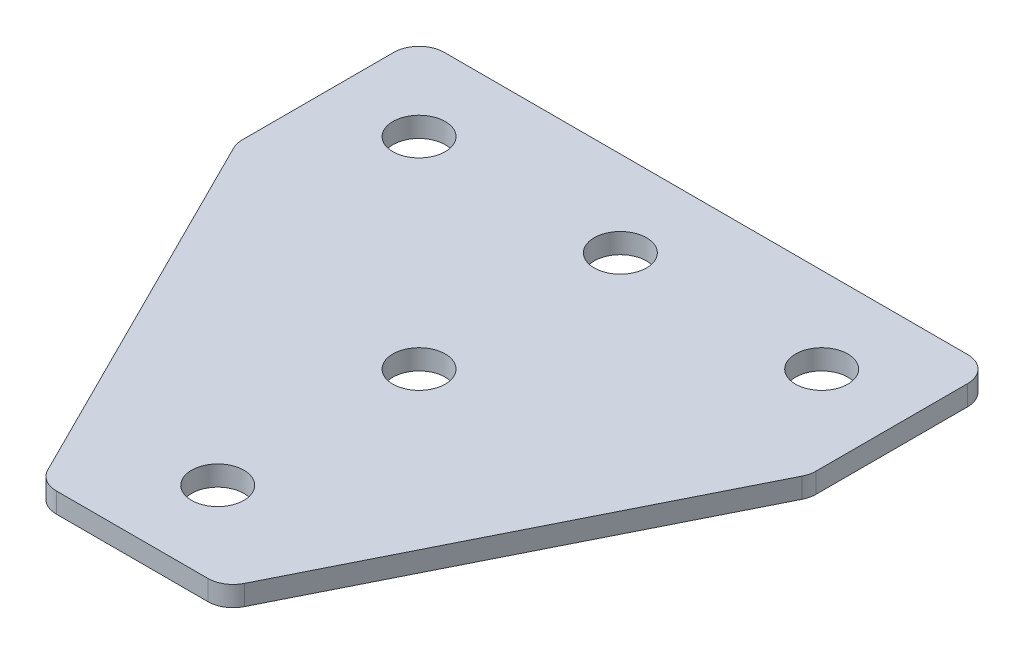
ISO-10303-21;
HEADER;
FILE_DESCRIPTION(('STEP AP214'),'2;1');
FILE_NAME('part.step','',(''),(''),'','','');
FILE_SCHEMA(('AUTOMOTIVE_DESIGN { 1 0 10303 214 1 1 1 1 }'));
ENDSEC;
DATA;
#1=APPLICATION_CONTEXT('core data for automotive mechanical design processes');
#2=APPLICATION_PROTOCOL_DEFINITION('international standard','automotive_design',2000,#1);
#3=PRODUCT_CONTEXT('',#1,'mechanical');
#4=PRODUCT('Part','Part','',(#3));
#5=PRODUCT_RELATED_PRODUCT_CATEGORY('part','',(#4));
#6=PRODUCT_DEFINITION_FORMATION('','',#4);
#7=PRODUCT_DEFINITION_CONTEXT('part definition',#1,'design');
#8=PRODUCT_DEFINITION('design','',#6,#7);
#9=PRODUCT_DEFINITION_SHAPE('','',#8);
#10=(LENGTH_UNIT() NAMED_UNIT(*) SI_UNIT(.MILLI.,.METRE.));
#11=(NAMED_UNIT(*) PLANE_ANGLE_UNIT() SI_UNIT($,.RADIAN.));
#12=(NAMED_UNIT(*) SI_UNIT($,.STERADIAN.) SOLID_ANGLE_UNIT());
#13=UNCERTAINTY_MEASURE_WITH_UNIT(LENGTH_MEASURE(1.E-05),#10,'distance_accuracy_value','');
#14=(GEOMETRIC_REPRESENTATION_CONTEXT(3) GLOBAL_UNCERTAINTY_ASSIGNED_CONTEXT((#13)) GLOBAL_UNIT_ASSIGNED_CONTEXT((#10,
#11,#12)) REPRESENTATION_CONTEXT('',''));
#15=CARTESIAN_POINT('',(0.,0.,0.));
#16=DIRECTION('',(0.,0.,1.));
#17=DIRECTION('',(1.,0.,0.));
#18=AXIS2_PLACEMENT_3D('',#15,#16,#17);
#19=CARTESIAN_POINT('',(-1.0203051665485,0.841431359764556,-20.8208269333067));
#20=DIRECTION('',(0.,-1.,0.));
#21=DIRECTION('',(0.,0.,-1.));
#22=AXIS2_PLACEMENT_3D('',#19,#20,#21);
#23=PLANE('',#22);
#24=CARTESIAN_POINT('',(-1.0203051665485,0.841431359764556,-20.8208269333067));
#25=DIRECTION('',(0.,1.,0.));
#26=DIRECTION('',(0.,0.,1.));
#27=AXIS2_PLACEMENT_3D('',#24,#25,#26);
#28=CIRCLE('',#27,2.6);
#29=CARTESIAN_POINT('',(-1.0203051665485,0.841431359764556,-18.2208269333067));
#30=VERTEX_POINT('',#29);
#31=EDGE_CURVE('E119',#30,#30,#28,.T.);
#32=ORIENTED_EDGE('',*,*,#31,.T.);
#33=EDGE_LOOP('',(#32));
#34=FACE_BOUND('',#33,.T.);
#35=DIRECTION('',(1.,0.,0.));
#36=VECTOR('',#35,1.);
#37=CARTESIAN_POINT('',(-9.52030516654855,0.841431359764556,27.6791730666932));
#38=LINE('',#37,#36);
#39=CARTESIAN_POINT('',(-8.54816921154896,0.841431359764556,27.6791730666932));
#40=VERTEX_POINT('',#39);
#41=CARTESIAN_POINT('',(6.50755887845198,0.841431359764556,27.6791730666932));
#42=VERTEX_POINT('',#41);
#43=EDGE_CURVE('E164',#40,#42,#38,.T.);
#44=ORIENTED_EDGE('',*,*,#43,.F.);
#45=CARTESIAN_POINT('',(-8.54816921154896,0.841431359764556,25.1791730666932));
#46=DIRECTION('',(0.,1.,0.));
#47=DIRECTION('',(0.,0.,-1.));
#48=AXIS2_PLACEMENT_3D('',#45,#46,#47);
#49=CIRCLE('',#48,2.5);
#50=CARTESIAN_POINT('',(-10.7842371890487,0.841431359764556,26.2972070554431));
#51=VERTEX_POINT('',#50);
#52=EDGE_CURVE('E221',#51,#40,#49,.T.);
#53=ORIENTED_EDGE('',*,*,#52,.F.);
#54=DIRECTION('',(-0.447213595499957,0.,-0.894427190999916));
#55=VECTOR('',#54,1.);
#56=CARTESIAN_POINT('',(-10.0932541834237,0.841431359764556,27.6791730666932));
#57=LINE('',#56,#55);
#58=CARTESIAN_POINT('',(-29.2563731440482,0.841431359764556,-10.6470648545559));
#59=VERTEX_POINT('',#58);
#60=EDGE_CURVE('E224',#51,#59,#57,.T.);
#61=ORIENTED_EDGE('',*,*,#60,.T.);
#62=CARTESIAN_POINT('',(-27.0203051665484,0.841431359764556,-11.7650988433058));
#63=DIRECTION('',(0.,1.,0.));
#64=DIRECTION('',(0.,0.,-1.));
#65=AXIS2_PLACEMENT_3D('',#62,#63,#64);
#66=CIRCLE('',#65,2.5);
#67=CARTESIAN_POINT('',(-29.5203051665484,0.841431359764556,-11.7650988433058));
#68=VERTEX_POINT('',#67);
#69=EDGE_CURVE('E227',#68,#59,#66,.T.);
#70=ORIENTED_EDGE('',*,*,#69,.F.);
#71=DIRECTION('',(0.,0.,-1.));
#72=VECTOR('',#71,1.);
#73=CARTESIAN_POINT('',(-29.5203051665484,0.841431359764556,-11.1749288995564));
#74=LINE('',#73,#72);
#75=CARTESIAN_POINT('',(-29.5203051665484,0.841431359764556,-26.8208269333068));
#76=VERTEX_POINT('',#75);
#77=EDGE_CURVE('E130',#68,#76,#74,.T.);
#78=ORIENTED_EDGE('',*,*,#77,.T.);
#79=CARTESIAN_POINT('',(-27.0203051665484,0.841431359764556,-26.8208269333068));
#80=DIRECTION('',(0.,1.,0.));
#81=DIRECTION('',(0.,0.,-1.));
#82=AXIS2_PLACEMENT_3D('',#79,#80,#81);
#83=CIRCLE('',#82,2.5);
#84=CARTESIAN_POINT('',(-27.0203051665484,0.841431359764556,-29.3208269333068));
#85=VERTEX_POINT('',#84);
#86=EDGE_CURVE('E233',#85,#76,#83,.T.);
#87=ORIENTED_EDGE('',*,*,#86,.F.);
#88=DIRECTION('',(-1.,0.,0.));
#89=VECTOR('',#88,1.);
#90=CARTESIAN_POINT('',(27.4796948334514,0.841431359764556,-29.3208269333068));
#91=LINE('',#90,#89);
#92=CARTESIAN_POINT('',(24.9796948334514,0.841431359764556,-29.3208269333068));
#93=VERTEX_POINT('',#92);
#94=EDGE_CURVE('E134',#93,#85,#91,.T.);
#95=ORIENTED_EDGE('',*,*,#94,.F.);
#96=CARTESIAN_POINT('',(24.9796948334514,0.841431359764556,-26.8208269333068));
#97=DIRECTION('',(0.,-1.,0.));
#98=DIRECTION('',(0.,0.,-1.));
#99=AXIS2_PLACEMENT_3D('',#96,#97,#98);
#100=CIRCLE('',#99,2.5);
#101=CARTESIAN_POINT('',(27.4796948334514,0.841431359764556,-26.8208269333068));
#102=VERTEX_POINT('',#101);
#103=EDGE_CURVE('E185',#93,#102,#100,.T.);
#104=ORIENTED_EDGE('',*,*,#103,.T.);
#105=DIRECTION('',(0.,0.,-1.));
#106=VECTOR('',#105,1.);
#107=CARTESIAN_POINT('',(27.4796948334514,0.841431359764556,-11.1749288995564));
#108=LINE('',#107,#106);
#109=CARTESIAN_POINT('',(27.4796948334514,0.841431359764556,-11.7650988433058));
#110=VERTEX_POINT('',#109);
#111=EDGE_CURVE('E169',#110,#102,#108,.T.);
#112=ORIENTED_EDGE('',*,*,#111,.F.);
#113=CARTESIAN_POINT('',(24.9796948334514,0.841431359764556,-11.7650988433058));
#114=DIRECTION('',(0.,-1.,0.));
#115=DIRECTION('',(0.,0.,-1.));
#116=AXIS2_PLACEMENT_3D('',#113,#114,#115);
#117=CIRCLE('',#116,2.5);
#118=CARTESIAN_POINT('',(27.2157628109512,0.841431359764556,-10.6470648545559));
#119=VERTEX_POINT('',#118);
#120=EDGE_CURVE('E31',#110,#119,#117,.T.);
#121=ORIENTED_EDGE('',*,*,#120,.T.);
#122=DIRECTION('',(0.447213595499956,0.,-0.894427190999917));
#123=VECTOR('',#122,1.);
#124=CARTESIAN_POINT('',(8.05264385032672,0.841431359764556,27.6791730666932));
#125=LINE('',#124,#123);
#126=CARTESIAN_POINT('',(8.74362685595177,0.841431359764556,26.2972070554431));
#127=VERTEX_POINT('',#126);
#128=EDGE_CURVE('E167',#127,#119,#125,.T.);
#129=ORIENTED_EDGE('',*,*,#128,.F.);
#130=CARTESIAN_POINT('',(6.50755887845198,0.841431359764556,25.1791730666932));
#131=DIRECTION('',(0.,-1.,0.));
#132=DIRECTION('',(0.,0.,-1.));
#133=AXIS2_PLACEMENT_3D('',#130,#131,#132);
#134=CIRCLE('',#133,2.5);
#135=EDGE_CURVE('E188',#127,#42,#134,.T.);
#136=ORIENTED_EDGE('',*,*,#135,.T.);
#137=EDGE_LOOP('',(#44,#53,#61,#70,#78,#87,#95,#104,#112,#121,#129,#136));
#138=FACE_BOUND('',#137,.T.);
#139=CARTESIAN_POINT('',(-1.02030516654851,0.841431359764556,19.1791730666933));
#140=DIRECTION('',(0.,1.,0.));
#141=DIRECTION('',(0.,0.,1.));
#142=AXIS2_PLACEMENT_3D('',#139,#140,#141);
#143=CIRCLE('',#142,2.6);
#144=CARTESIAN_POINT('',(-1.02030516654851,0.841431359764556,21.7791730666933));
#145=VERTEX_POINT('',#144);
#146=EDGE_CURVE('E139',#145,#145,#143,.T.);
#147=ORIENTED_EDGE('',*,*,#146,.T.);
#148=EDGE_LOOP('',(#147));
#149=FACE_BOUND('',#148,.T.);
#150=CARTESIAN_POINT('',(-1.02030516654851,0.841431359764556,-0.820826933306717));
#151=DIRECTION('',(0.,1.,0.));
#152=DIRECTION('',(0.,0.,1.));
#153=AXIS2_PLACEMENT_3D('',#150,#151,#152);
#154=CIRCLE('',#153,2.6);
#155=CARTESIAN_POINT('',(-1.02030516654851,0.841431359764556,1.77917306669328));
#156=VERTEX_POINT('',#155);
#157=EDGE_CURVE('E147',#156,#156,#154,.T.);
#158=ORIENTED_EDGE('',*,*,#157,.T.);
#159=EDGE_LOOP('',(#158));
#160=FACE_BOUND('',#159,.T.);
#161=CARTESIAN_POINT('',(18.9796948334515,0.841431359764556,-20.8208269333067));
#162=DIRECTION('',(0.,1.,0.));
#163=DIRECTION('',(0.,0.,1.));
#164=AXIS2_PLACEMENT_3D('',#161,#162,#163);
#165=CIRCLE('',#164,2.6);
#166=CARTESIAN_POINT('',(18.9796948334515,0.841431359764556,-18.2208269333067));
#167=VERTEX_POINT('',#166);
#168=EDGE_CURVE('E153',#167,#167,#165,.T.);
#169=ORIENTED_EDGE('',*,*,#168,.T.);
#170=EDGE_LOOP('',(#169));
#171=FACE_BOUND('',#170,.T.);
#172=CARTESIAN_POINT('',(-21.0203051665485,0.841431359764556,-20.8208269333067));
#173=DIRECTION('',(0.,-1.,0.));
#174=DIRECTION('',(0.,0.,1.));
#175=AXIS2_PLACEMENT_3D('',#172,#173,#174);
#176=CIRCLE('',#175,2.6);
#177=CARTESIAN_POINT('',(-21.0203051665485,0.841431359764556,-18.2208269333067));
#178=VERTEX_POINT('',#177);
#179=EDGE_CURVE('E254',#178,#178,#176,.T.);
#180=ORIENTED_EDGE('',*,*,#179,.F.);
#181=EDGE_LOOP('',(#180));
#182=FACE_BOUND('',#181,.T.);
#183=ADVANCED_FACE('F16',(#34,#138,#149,#160,#171,#182),#23,.T.);
#184=CARTESIAN_POINT('',(27.4796948334514,0.841431359764556,-29.3208269333068));
#185=DIRECTION('',(0.,0.,-1.));
#186=DIRECTION('',(-1.,0.,0.));
#187=AXIS2_PLACEMENT_3D('',#184,#185,#186);
#188=PLANE('',#187);
#189=ORIENTED_EDGE('',*,*,#94,.T.);
#190=DIRECTION('',(0.,1.,0.));
#191=VECTOR('',#190,1.);
#192=CARTESIAN_POINT('',(-27.0203051665484,0.841431359764556,-29.3208269333068));
#193=LINE('',#192,#191);
#194=CARTESIAN_POINT('',(-27.0203051665484,2.84143135976456,-29.3208269333068));
#195=VERTEX_POINT('',#194);
#196=EDGE_CURVE('E125',#195,#85,#193,.F.);
#197=ORIENTED_EDGE('',*,*,#196,.F.);
#198=DIRECTION('',(-1.,0.,0.));
#199=VECTOR('',#198,1.);
#200=CARTESIAN_POINT('',(27.4796948334514,2.84143135976456,-29.3208269333068));
#201=LINE('',#200,#199);
#202=CARTESIAN_POINT('',(24.9796948334514,2.84143135976456,-29.3208269333068));
#203=VERTEX_POINT('',#202);
#204=EDGE_CURVE('E105',#203,#195,#201,.T.);
#205=ORIENTED_EDGE('',*,*,#204,.F.);
#206=DIRECTION('',(0.,1.,0.));
#207=VECTOR('',#206,1.);
#208=CARTESIAN_POINT('',(24.9796948334514,0.841431359764556,-29.3208269333068));
#209=LINE('',#208,#207);
#210=EDGE_CURVE('E10',#203,#93,#209,.F.);
#211=ORIENTED_EDGE('',*,*,#210,.T.);
#212=EDGE_LOOP('',(#189,#197,#205,#211));
#213=FACE_BOUND('',#212,.T.);
#214=ADVANCED_FACE('F132',(#213),#188,.T.);
#215=CARTESIAN_POINT('',(27.4796948334514,0.841431359764556,-11.1749288995564));
#216=DIRECTION('',(1.,0.,0.));
#217=DIRECTION('',(0.,0.,-1.));
#218=AXIS2_PLACEMENT_3D('',#215,#216,#217);
#219=PLANE('',#218);
#220=DIRECTION('',(0.,0.,-1.));
#221=VECTOR('',#220,1.);
#222=CARTESIAN_POINT('',(27.4796948334514,2.84143135976456,-11.1749288995564));
#223=LINE('',#222,#221);
#224=CARTESIAN_POINT('',(27.4796948334514,2.84143135976456,-11.7650988433058));
#225=VERTEX_POINT('',#224);
#226=CARTESIAN_POINT('',(27.4796948334514,2.84143135976456,-26.8208269333068));
#227=VERTEX_POINT('',#226);
#228=EDGE_CURVE('E165',#225,#227,#223,.T.);
#229=ORIENTED_EDGE('',*,*,#228,.F.);
#230=DIRECTION('',(0.,1.,0.));
#231=VECTOR('',#230,1.);
#232=CARTESIAN_POINT('',(27.4796948334514,0.841431359764556,-11.7650988433058));
#233=LINE('',#232,#231);
#234=EDGE_CURVE('E24',#225,#110,#233,.F.);
#235=ORIENTED_EDGE('',*,*,#234,.T.);
#236=ORIENTED_EDGE('',*,*,#111,.T.);
#237=DIRECTION('',(0.,1.,0.));
#238=VECTOR('',#237,1.);
#239=CARTESIAN_POINT('',(27.4796948334514,0.841431359764556,-26.8208269333068));
#240=LINE('',#239,#238);
#241=EDGE_CURVE('E195',#102,#227,#240,.T.);
#242=ORIENTED_EDGE('',*,*,#241,.T.);
#243=EDGE_LOOP('',(#229,#235,#236,#242));
#244=FACE_BOUND('',#243,.T.);
#245=ADVANCED_FACE('F200',(#244),#219,.T.);
#246=CARTESIAN_POINT('',(8.05264385032672,0.841431359764556,27.6791730666932));
#247=DIRECTION('',(0.894427190999917,0.,0.447213595499956));
#248=DIRECTION('',(0.447213595499957,0.,-0.894427190999917));
#249=AXIS2_PLACEMENT_3D('',#246,#247,#248);
#250=PLANE('',#249);
#251=DIRECTION('',(0.447213595499956,0.,-0.894427190999917));
#252=VECTOR('',#251,1.);
#253=CARTESIAN_POINT('',(8.05264385032672,2.84143135976456,27.6791730666932));
#254=LINE('',#253,#252);
#255=CARTESIAN_POINT('',(8.74362685595177,2.84143135976456,26.2972070554431));
#256=VERTEX_POINT('',#255);
#257=CARTESIAN_POINT('',(27.2157628109512,2.84143135976456,-10.6470648545559));
#258=VERTEX_POINT('',#257);
#259=EDGE_CURVE('E173',#256,#258,#254,.T.);
#260=ORIENTED_EDGE('',*,*,#259,.F.);
#261=DIRECTION('',(0.,1.,0.));
#262=VECTOR('',#261,1.);
#263=CARTESIAN_POINT('',(8.74362685595177,0.841431359764556,26.2972070554431));
#264=LINE('',#263,#262);
#265=EDGE_CURVE('E38',#256,#127,#264,.F.);
#266=ORIENTED_EDGE('',*,*,#265,.T.);
#267=ORIENTED_EDGE('',*,*,#128,.T.);
#268=DIRECTION('',(0.,1.,0.));
#269=VECTOR('',#268,1.);
#270=CARTESIAN_POINT('',(27.2157628109512,0.841431359764556,-10.647064854556));
#271=LINE('',#270,#269);
#272=EDGE_CURVE('E191',#119,#258,#271,.T.);
#273=ORIENTED_EDGE('',*,*,#272,.T.);
#274=EDGE_LOOP('',(#260,#266,#267,#273));
#275=FACE_BOUND('',#274,.T.);
#276=ADVANCED_FACE('F207',(#275),#250,.T.);
#277=CARTESIAN_POINT('',(-9.52030516654855,0.841431359764556,27.6791730666932));
#278=DIRECTION('',(0.,0.,1.));
#279=DIRECTION('',(1.,0.,0.));
#280=AXIS2_PLACEMENT_3D('',#277,#278,#279);
#281=PLANE('',#280);
#282=DIRECTION('',(1.,0.,0.));
#283=VECTOR('',#282,1.);
#284=CARTESIAN_POINT('',(-9.52030516654855,2.84143135976456,27.6791730666932));
#285=LINE('',#284,#283);
#286=CARTESIAN_POINT('',(-8.54816921154896,2.84143135976456,27.6791730666932));
#287=VERTEX_POINT('',#286);
#288=CARTESIAN_POINT('',(6.50755887845198,2.84143135976456,27.6791730666932));
#289=VERTEX_POINT('',#288);
#290=EDGE_CURVE('E118',#287,#289,#285,.T.);
#291=ORIENTED_EDGE('',*,*,#290,.F.);
#292=DIRECTION('',(0.,1.,0.));
#293=VECTOR('',#292,1.);
#294=CARTESIAN_POINT('',(-8.54816921154896,0.841431359764556,27.6791730666932));
#295=LINE('',#294,#293);
#296=EDGE_CURVE('E217',#40,#287,#295,.T.);
#297=ORIENTED_EDGE('',*,*,#296,.F.);
#298=ORIENTED_EDGE('',*,*,#43,.T.);
#299=DIRECTION('',(0.,1.,0.));
#300=VECTOR('',#299,1.);
#301=CARTESIAN_POINT('',(6.50755887845198,0.841431359764556,27.6791730666932));
#302=LINE('',#301,#300);
#303=EDGE_CURVE('E182',#42,#289,#302,.T.);
#304=ORIENTED_EDGE('',*,*,#303,.T.);
#305=EDGE_LOOP('',(#291,#297,#298,#304));
#306=FACE_BOUND('',#305,.T.);
#307=ADVANCED_FACE('F214',(#306),#281,.T.);
#308=CARTESIAN_POINT('',(-1.0203051665485,2.84143135976456,-20.8208269333067));
#309=DIRECTION('',(0.,-1.,0.));
#310=DIRECTION('',(0.,0.,-1.));
#311=AXIS2_PLACEMENT_3D('',#308,#309,#310);
#312=PLANE('',#311);
#313=CARTESIAN_POINT('',(-1.0203051665485,2.84143135976456,-20.8208269333067));
#314=DIRECTION('',(0.,1.,0.));
#315=DIRECTION('',(0.,0.,1.));
#316=AXIS2_PLACEMENT_3D('',#313,#314,#315);
#317=CIRCLE('',#316,2.6);
#318=CARTESIAN_POINT('',(-1.0203051665485,2.84143135976456,-18.2208269333067));
#319=VERTEX_POINT('',#318);
#320=EDGE_CURVE('E156',#319,#319,#317,.T.);
#321=ORIENTED_EDGE('',*,*,#320,.F.);
#322=EDGE_LOOP('',(#321));
#323=FACE_BOUND('',#322,.T.);
#324=CARTESIAN_POINT('',(-8.54816921154896,2.84143135976456,25.1791730666932));
#325=DIRECTION('',(0.,1.,0.));
#326=DIRECTION('',(0.,0.,-1.));
#327=AXIS2_PLACEMENT_3D('',#324,#325,#326);
#328=CIRCLE('',#327,2.5);
#329=CARTESIAN_POINT('',(-10.7842371890487,2.84143135976456,26.2972070554431));
#330=VERTEX_POINT('',#329);
#331=EDGE_CURVE('E239',#287,#330,#328,.F.);
#332=ORIENTED_EDGE('',*,*,#331,.F.);
#333=ORIENTED_EDGE('',*,*,#290,.T.);
#334=CARTESIAN_POINT('',(6.50755887845198,2.84143135976456,25.1791730666932));
#335=DIRECTION('',(0.,-1.,0.));
#336=DIRECTION('',(0.,0.,-1.));
#337=AXIS2_PLACEMENT_3D('',#334,#335,#336);
#338=CIRCLE('',#337,2.5);
#339=EDGE_CURVE('E180',#289,#256,#338,.F.);
#340=ORIENTED_EDGE('',*,*,#339,.T.);
#341=ORIENTED_EDGE('',*,*,#259,.T.);
#342=CARTESIAN_POINT('',(24.9796948334514,2.84143135976456,-11.7650988433058));
#343=DIRECTION('',(0.,-1.,0.));
#344=DIRECTION('',(0.,0.,-1.));
#345=AXIS2_PLACEMENT_3D('',#342,#343,#344);
#346=CIRCLE('',#345,2.5);
#347=EDGE_CURVE('E178',#258,#225,#346,.F.);
#348=ORIENTED_EDGE('',*,*,#347,.T.);
#349=ORIENTED_EDGE('',*,*,#228,.T.);
#350=CARTESIAN_POINT('',(24.9796948334514,2.84143135976456,-26.8208269333068));
#351=DIRECTION('',(0.,-1.,0.));
#352=DIRECTION('',(0.,0.,-1.));
#353=AXIS2_PLACEMENT_3D('',#350,#351,#352);
#354=CIRCLE('',#353,2.5);
#355=EDGE_CURVE('E114',#227,#203,#354,.F.);
#356=ORIENTED_EDGE('',*,*,#355,.T.);
#357=ORIENTED_EDGE('',*,*,#204,.T.);
#358=CARTESIAN_POINT('',(-27.0203051665484,2.84143135976456,-26.8208269333068));
#359=DIRECTION('',(0.,1.,0.));
#360=DIRECTION('',(0.,0.,-1.));
#361=AXIS2_PLACEMENT_3D('',#358,#359,#360);
#362=CIRCLE('',#361,2.5);
#363=CARTESIAN_POINT('',(-29.5203051665484,2.84143135976456,-26.8208269333068));
#364=VERTEX_POINT('',#363);
#365=EDGE_CURVE('E111',#364,#195,#362,.F.);
#366=ORIENTED_EDGE('',*,*,#365,.F.);
#367=DIRECTION('',(0.,0.,-1.));
#368=VECTOR('',#367,1.);
#369=CARTESIAN_POINT('',(-29.5203051665484,2.84143135976456,-11.1749288995564));
#370=LINE('',#369,#368);
#371=CARTESIAN_POINT('',(-29.5203051665484,2.84143135976456,-11.7650988433058));
#372=VERTEX_POINT('',#371);
#373=EDGE_CURVE('E244',#372,#364,#370,.T.);
#374=ORIENTED_EDGE('',*,*,#373,.F.);
#375=CARTESIAN_POINT('',(-27.0203051665484,2.84143135976456,-11.7650988433058));
#376=DIRECTION('',(0.,1.,0.));
#377=DIRECTION('',(0.,0.,-1.));
#378=AXIS2_PLACEMENT_3D('',#375,#376,#377);
#379=CIRCLE('',#378,2.5);
#380=CARTESIAN_POINT('',(-29.2563731440482,2.84143135976456,-10.6470648545559));
#381=VERTEX_POINT('',#380);
#382=EDGE_CURVE('E129',#381,#372,#379,.F.);
#383=ORIENTED_EDGE('',*,*,#382,.F.);
#384=DIRECTION('',(-0.447213595499957,0.,-0.894427190999916));
#385=VECTOR('',#384,1.);
#386=CARTESIAN_POINT('',(-10.0932541834237,2.84143135976456,27.6791730666932));
#387=LINE('',#386,#385);
#388=EDGE_CURVE('E248',#330,#381,#387,.T.);
#389=ORIENTED_EDGE('',*,*,#388,.F.);
#390=EDGE_LOOP('',(#332,#333,#340,#341,#348,#349,#356,#357,#366,#374,#383,#389));
#391=FACE_BOUND('',#390,.T.);
#392=CARTESIAN_POINT('',(-1.02030516654851,2.84143135976456,19.1791730666933));
#393=DIRECTION('',(0.,1.,0.));
#394=DIRECTION('',(0.,0.,1.));
#395=AXIS2_PLACEMENT_3D('',#392,#393,#394);
#396=CIRCLE('',#395,2.6);
#397=CARTESIAN_POINT('',(-1.02030516654851,2.84143135976456,21.7791730666933));
#398=VERTEX_POINT('',#397);
#399=EDGE_CURVE('E135',#398,#398,#396,.T.);
#400=ORIENTED_EDGE('',*,*,#399,.F.);
#401=EDGE_LOOP('',(#400));
#402=FACE_BOUND('',#401,.T.);
#403=CARTESIAN_POINT('',(18.9796948334515,2.84143135976456,-20.8208269333067));
#404=DIRECTION('',(0.,1.,0.));
#405=DIRECTION('',(0.,0.,1.));
#406=AXIS2_PLACEMENT_3D('',#403,#404,#405);
#407=CIRCLE('',#406,2.6);
#408=CARTESIAN_POINT('',(18.9796948334515,2.84143135976456,-18.2208269333067));
#409=VERTEX_POINT('',#408);
#410=EDGE_CURVE('E150',#409,#409,#407,.T.);
#411=ORIENTED_EDGE('',*,*,#410,.F.);
#412=EDGE_LOOP('',(#411));
#413=FACE_BOUND('',#412,.T.);
#414=CARTESIAN_POINT('',(-1.02030516654851,2.84143135976456,-0.820826933306717));
#415=DIRECTION('',(0.,1.,0.));
#416=DIRECTION('',(0.,0.,1.));
#417=AXIS2_PLACEMENT_3D('',#414,#415,#416);
#418=CIRCLE('',#417,2.6);
#419=CARTESIAN_POINT('',(-1.02030516654851,2.84143135976456,1.77917306669328));
#420=VERTEX_POINT('',#419);
#421=EDGE_CURVE('E145',#420,#420,#418,.T.);
#422=ORIENTED_EDGE('',*,*,#421,.F.);
#423=EDGE_LOOP('',(#422));
#424=FACE_BOUND('',#423,.T.);
#425=CARTESIAN_POINT('',(-21.0203051665485,2.84143135976456,-20.8208269333067));
#426=DIRECTION('',(0.,-1.,0.));
#427=DIRECTION('',(0.,0.,1.));
#428=AXIS2_PLACEMENT_3D('',#425,#426,#427);
#429=CIRCLE('',#428,2.6);
#430=CARTESIAN_POINT('',(-21.0203051665485,2.84143135976456,-18.2208269333067));
#431=VERTEX_POINT('',#430);
#432=EDGE_CURVE('E251',#431,#431,#429,.T.);
#433=ORIENTED_EDGE('',*,*,#432,.T.);
#434=EDGE_LOOP('',(#433));
#435=FACE_BOUND('',#434,.T.);
#436=ADVANCED_FACE('F108',(#323,#391,#402,#413,#424,#435),#312,.F.);
#437=CARTESIAN_POINT('',(6.50755887845198,0.841431359764556,25.1791730666932));
#438=DIRECTION('',(0.,1.,0.));
#439=DIRECTION('',(0.,0.,1.));
#440=AXIS2_PLACEMENT_3D('',#437,#438,#439);
#441=CYLINDRICAL_SURFACE('',#440,2.5);
#442=ORIENTED_EDGE('',*,*,#135,.F.);
#443=ORIENTED_EDGE('',*,*,#265,.F.);
#444=ORIENTED_EDGE('',*,*,#339,.F.);
#445=ORIENTED_EDGE('',*,*,#303,.F.);
#446=EDGE_LOOP('',(#442,#443,#444,#445));
#447=FACE_BOUND('',#446,.T.);
#448=ADVANCED_FACE('F212',(#447),#441,.T.);
#449=CARTESIAN_POINT('',(24.9796948334514,0.841431359764556,-11.7650988433058));
#450=DIRECTION('',(0.,1.,0.));
#451=DIRECTION('',(0.,0.,1.));
#452=AXIS2_PLACEMENT_3D('',#449,#450,#451);
#453=CYLINDRICAL_SURFACE('',#452,2.5);
#454=ORIENTED_EDGE('',*,*,#120,.F.);
#455=ORIENTED_EDGE('',*,*,#234,.F.);
#456=ORIENTED_EDGE('',*,*,#347,.F.);
#457=ORIENTED_EDGE('',*,*,#272,.F.);
#458=EDGE_LOOP('',(#454,#455,#456,#457));
#459=FACE_BOUND('',#458,.T.);
#460=ADVANCED_FACE('F206',(#459),#453,.T.);
#461=CARTESIAN_POINT('',(24.9796948334514,0.841431359764556,-26.8208269333068));
#462=DIRECTION('',(0.,1.,0.));
#463=DIRECTION('',(0.,0.,1.));
#464=AXIS2_PLACEMENT_3D('',#461,#462,#463);
#465=CYLINDRICAL_SURFACE('',#464,2.5);
#466=ORIENTED_EDGE('',*,*,#103,.F.);
#467=ORIENTED_EDGE('',*,*,#210,.F.);
#468=ORIENTED_EDGE('',*,*,#355,.F.);
#469=ORIENTED_EDGE('',*,*,#241,.F.);
#470=EDGE_LOOP('',(#466,#467,#468,#469));
#471=FACE_BOUND('',#470,.T.);
#472=ADVANCED_FACE('F18',(#471),#465,.T.);
#473=CARTESIAN_POINT('',(-1.0203051665485,0.841431359764556,-20.8208269333067));
#474=DIRECTION('',(0.,1.,0.));
#475=DIRECTION('',(0.,0.,1.));
#476=AXIS2_PLACEMENT_3D('',#473,#474,#475);
#477=CYLINDRICAL_SURFACE('',#476,2.6);
#478=ORIENTED_EDGE('',*,*,#31,.F.);
#479=EDGE_LOOP('',(#478));
#480=FACE_BOUND('',#479,.T.);
#481=ORIENTED_EDGE('',*,*,#320,.T.);
#482=EDGE_LOOP('',(#481));
#483=FACE_BOUND('',#482,.T.);
#484=ADVANCED_FACE('F288',(#480,#483),#477,.F.);
#485=CARTESIAN_POINT('',(18.9796948334515,0.841431359764556,-20.8208269333067));
#486=DIRECTION('',(0.,1.,0.));
#487=DIRECTION('',(0.,0.,1.));
#488=AXIS2_PLACEMENT_3D('',#485,#486,#487);
#489=CYLINDRICAL_SURFACE('',#488,2.6);
#490=ORIENTED_EDGE('',*,*,#168,.F.);
#491=EDGE_LOOP('',(#490));
#492=FACE_BOUND('',#491,.T.);
#493=ORIENTED_EDGE('',*,*,#410,.T.);
#494=EDGE_LOOP('',(#493));
#495=FACE_BOUND('',#494,.T.);
#496=ADVANCED_FACE('F293',(#492,#495),#489,.F.);
#497=CARTESIAN_POINT('',(-1.02030516654851,0.841431359764556,-0.820826933306717));
#498=DIRECTION('',(0.,1.,0.));
#499=DIRECTION('',(0.,0.,1.));
#500=AXIS2_PLACEMENT_3D('',#497,#498,#499);
#501=CYLINDRICAL_SURFACE('',#500,2.6);
#502=ORIENTED_EDGE('',*,*,#421,.T.);
#503=EDGE_LOOP('',(#502));
#504=FACE_BOUND('',#503,.T.);
#505=ORIENTED_EDGE('',*,*,#157,.F.);
#506=EDGE_LOOP('',(#505));
#507=FACE_BOUND('',#506,.T.);
#508=ADVANCED_FACE('F299',(#504,#507),#501,.F.);
#509=CARTESIAN_POINT('',(-1.02030516654851,0.841431359764556,19.1791730666933));
#510=DIRECTION('',(0.,1.,0.));
#511=DIRECTION('',(0.,0.,1.));
#512=AXIS2_PLACEMENT_3D('',#509,#510,#511);
#513=CYLINDRICAL_SURFACE('',#512,2.6);
#514=ORIENTED_EDGE('',*,*,#399,.T.);
#515=EDGE_LOOP('',(#514));
#516=FACE_BOUND('',#515,.T.);
#517=ORIENTED_EDGE('',*,*,#146,.F.);
#518=EDGE_LOOP('',(#517));
#519=FACE_BOUND('',#518,.T.);
#520=ADVANCED_FACE('F354',(#516,#519),#513,.F.);
#521=CARTESIAN_POINT('',(-29.5203051665484,0.841431359764556,-11.1749288995564));
#522=DIRECTION('',(-1.,0.,0.));
#523=DIRECTION('',(0.,0.,-1.));
#524=AXIS2_PLACEMENT_3D('',#521,#522,#523);
#525=PLANE('',#524);
#526=ORIENTED_EDGE('',*,*,#373,.T.);
#527=DIRECTION('',(0.,1.,0.));
#528=VECTOR('',#527,1.);
#529=CARTESIAN_POINT('',(-29.5203051665484,0.841431359764556,-26.8208269333068));
#530=LINE('',#529,#528);
#531=EDGE_CURVE('E127',#76,#364,#530,.T.);
#532=ORIENTED_EDGE('',*,*,#531,.F.);
#533=ORIENTED_EDGE('',*,*,#77,.F.);
#534=DIRECTION('',(0.,1.,0.));
#535=VECTOR('',#534,1.);
#536=CARTESIAN_POINT('',(-29.5203051665484,0.841431359764556,-11.7650988433058));
#537=LINE('',#536,#535);
#538=EDGE_CURVE('E136',#372,#68,#537,.F.);
#539=ORIENTED_EDGE('',*,*,#538,.F.);
#540=EDGE_LOOP('',(#526,#532,#533,#539));
#541=FACE_BOUND('',#540,.T.);
#542=ADVANCED_FACE('F261',(#541),#525,.T.);
#543=CARTESIAN_POINT('',(-10.0932541834237,0.841431359764556,27.6791730666932));
#544=DIRECTION('',(-0.894427190999916,0.,0.447213595499957));
#545=DIRECTION('',(-0.447213595499957,0.,-0.894427190999917));
#546=AXIS2_PLACEMENT_3D('',#543,#544,#545);
#547=PLANE('',#546);
#548=ORIENTED_EDGE('',*,*,#388,.T.);
#549=DIRECTION('',(0.,1.,0.));
#550=VECTOR('',#549,1.);
#551=CARTESIAN_POINT('',(-29.2563731440482,0.841431359764556,-10.6470648545559));
#552=LINE('',#551,#550);
#553=EDGE_CURVE('E226',#59,#381,#552,.T.);
#554=ORIENTED_EDGE('',*,*,#553,.F.);
#555=ORIENTED_EDGE('',*,*,#60,.F.);
#556=DIRECTION('',(0.,1.,0.));
#557=VECTOR('',#556,1.);
#558=CARTESIAN_POINT('',(-10.7842371890487,0.841431359764556,26.2972070554431));
#559=LINE('',#558,#557);
#560=EDGE_CURVE('E230',#330,#51,#559,.F.);
#561=ORIENTED_EDGE('',*,*,#560,.F.);
#562=EDGE_LOOP('',(#548,#554,#555,#561));
#563=FACE_BOUND('',#562,.T.);
#564=ADVANCED_FACE('F243',(#563),#547,.T.);
#565=CARTESIAN_POINT('',(-8.54816921154896,0.841431359764556,25.1791730666932));
#566=DIRECTION('',(0.,1.,0.));
#567=DIRECTION('',(0.,0.,1.));
#568=AXIS2_PLACEMENT_3D('',#565,#566,#567);
#569=CYLINDRICAL_SURFACE('',#568,2.5);
#570=ORIENTED_EDGE('',*,*,#52,.T.);
#571=ORIENTED_EDGE('',*,*,#296,.T.);
#572=ORIENTED_EDGE('',*,*,#331,.T.);
#573=ORIENTED_EDGE('',*,*,#560,.T.);
#574=EDGE_LOOP('',(#570,#571,#572,#573));
#575=FACE_BOUND('',#574,.T.);
#576=ADVANCED_FACE('F238',(#575),#569,.T.);
#577=CARTESIAN_POINT('',(-27.0203051665484,0.841431359764556,-11.7650988433058));
#578=DIRECTION('',(0.,1.,0.));
#579=DIRECTION('',(0.,0.,1.));
#580=AXIS2_PLACEMENT_3D('',#577,#578,#579);
#581=CYLINDRICAL_SURFACE('',#580,2.5);
#582=ORIENTED_EDGE('',*,*,#69,.T.);
#583=ORIENTED_EDGE('',*,*,#553,.T.);
#584=ORIENTED_EDGE('',*,*,#382,.T.);
#585=ORIENTED_EDGE('',*,*,#538,.T.);
#586=EDGE_LOOP('',(#582,#583,#584,#585));
#587=FACE_BOUND('',#586,.T.);
#588=ADVANCED_FACE('F263',(#587),#581,.T.);
#589=CARTESIAN_POINT('',(-27.0203051665484,0.841431359764556,-26.8208269333068));
#590=DIRECTION('',(0.,1.,0.));
#591=DIRECTION('',(0.,0.,1.));
#592=AXIS2_PLACEMENT_3D('',#589,#590,#591);
#593=CYLINDRICAL_SURFACE('',#592,2.5);
#594=ORIENTED_EDGE('',*,*,#86,.T.);
#595=ORIENTED_EDGE('',*,*,#531,.T.);
#596=ORIENTED_EDGE('',*,*,#365,.T.);
#597=ORIENTED_EDGE('',*,*,#196,.T.);
#598=EDGE_LOOP('',(#594,#595,#596,#597));
#599=FACE_BOUND('',#598,.T.);
#600=ADVANCED_FACE('F124',(#599),#593,.T.);
#601=CARTESIAN_POINT('',(-21.0203051665485,0.841431359764556,-20.8208269333067));
#602=DIRECTION('',(0.,1.,0.));
#603=DIRECTION('',(0.,0.,1.));
#604=AXIS2_PLACEMENT_3D('',#601,#602,#603);
#605=CYLINDRICAL_SURFACE('',#604,2.6);
#606=ORIENTED_EDGE('',*,*,#179,.T.);
#607=EDGE_LOOP('',(#606));
#608=FACE_BOUND('',#607,.T.);
#609=ORIENTED_EDGE('',*,*,#432,.F.);
#610=EDGE_LOOP('',(#609));
#611=FACE_BOUND('',#610,.T.);
#612=ADVANCED_FACE('F271',(#608,#611),#605,.F.);
#613=CLOSED_SHELL('',(#183,#214,#245,#276,#307,#436,#448,#460,#472,#484,#496,#508,#520,#542,
#564,#576,#588,#600,#612));
#614=MANIFOLD_SOLID_BREP('B1',#613);
#615=ADVANCED_BREP_SHAPE_REPRESENTATION('',(#18,#614),#14);
#616=SHAPE_DEFINITION_REPRESENTATION(#9,#615);
ENDSEC;
END-ISO-10303-21;
